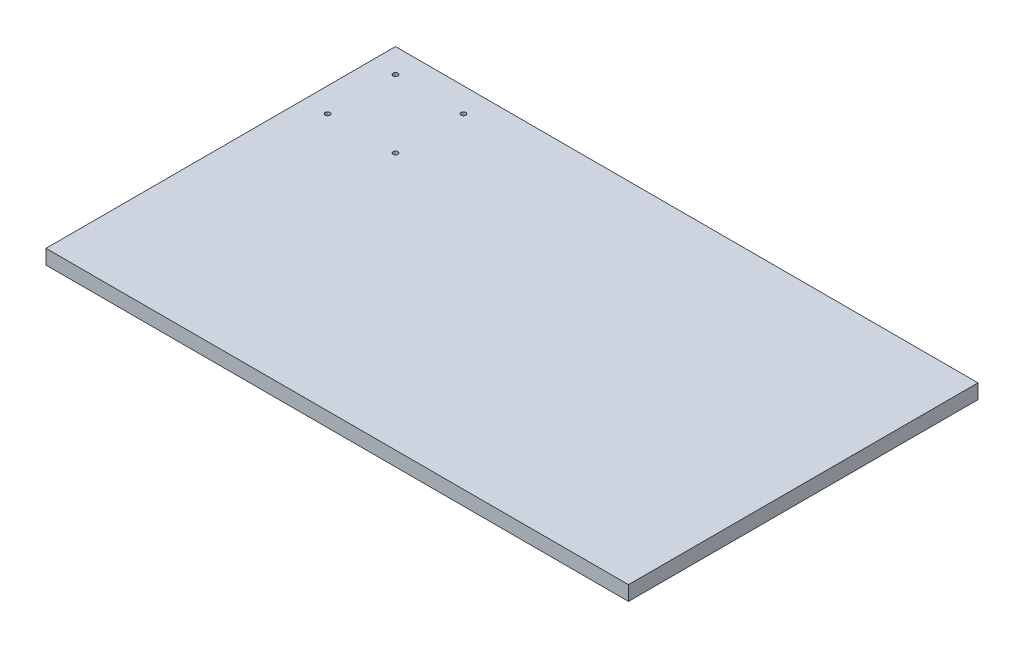
ISO-10303-21;
HEADER;
FILE_DESCRIPTION(('STEP AP214'),'2;1');
FILE_NAME('part.step','',(''),(''),'','','');
FILE_SCHEMA(('AUTOMOTIVE_DESIGN { 1 0 10303 214 1 1 1 1 }'));
ENDSEC;
DATA;
#1=APPLICATION_CONTEXT('core data for automotive mechanical design processes');
#2=APPLICATION_PROTOCOL_DEFINITION('international standard','automotive_design',2000,#1);
#3=PRODUCT_CONTEXT('',#1,'mechanical');
#4=PRODUCT('Part','Part','',(#3));
#5=PRODUCT_RELATED_PRODUCT_CATEGORY('part','',(#4));
#6=PRODUCT_DEFINITION_FORMATION('','',#4);
#7=PRODUCT_DEFINITION_CONTEXT('part definition',#1,'design');
#8=PRODUCT_DEFINITION('design','',#6,#7);
#9=PRODUCT_DEFINITION_SHAPE('','',#8);
#10=(LENGTH_UNIT() NAMED_UNIT(*) SI_UNIT(.MILLI.,.METRE.));
#11=(NAMED_UNIT(*) PLANE_ANGLE_UNIT() SI_UNIT($,.RADIAN.));
#12=(NAMED_UNIT(*) SI_UNIT($,.STERADIAN.) SOLID_ANGLE_UNIT());
#13=UNCERTAINTY_MEASURE_WITH_UNIT(LENGTH_MEASURE(1.E-05),#10,'distance_accuracy_value','');
#14=(GEOMETRIC_REPRESENTATION_CONTEXT(3) GLOBAL_UNCERTAINTY_ASSIGNED_CONTEXT((#13)) GLOBAL_UNIT_ASSIGNED_CONTEXT((#10,
#11,#12)) REPRESENTATION_CONTEXT('',''));
#15=CARTESIAN_POINT('',(0.,0.,0.));
#16=DIRECTION('',(0.,0.,1.));
#17=DIRECTION('',(1.,0.,0.));
#18=AXIS2_PLACEMENT_3D('',#15,#16,#17);
#19=CARTESIAN_POINT('',(0.,76.2,0.));
#20=DIRECTION('',(1.,0.,0.));
#21=DIRECTION('',(0.,0.,-1.));
#22=AXIS2_PLACEMENT_3D('',#19,#20,#21);
#23=PLANE('',#22);
#24=DIRECTION('',(0.,0.,1.));
#25=VECTOR('',#24,1.);
#26=CARTESIAN_POINT('',(0.,0.,0.));
#27=LINE('',#26,#25);
#28=CARTESIAN_POINT('',(0.,0.,-1828.8));
#29=VERTEX_POINT('',#28);
#30=CARTESIAN_POINT('',(0.,0.,0.));
#31=VERTEX_POINT('',#30);
#32=EDGE_CURVE('E147',#29,#31,#27,.T.);
#33=ORIENTED_EDGE('',*,*,#32,.T.);
#34=DIRECTION('',(0.,-1.,0.));
#35=VECTOR('',#34,1.);
#36=CARTESIAN_POINT('',(0.,76.2,0.));
#37=LINE('',#36,#35);
#38=CARTESIAN_POINT('',(0.,76.2,0.));
#39=VERTEX_POINT('',#38);
#40=EDGE_CURVE('E171',#39,#31,#37,.T.);
#41=ORIENTED_EDGE('',*,*,#40,.F.);
#42=DIRECTION('',(0.,0.,1.));
#43=VECTOR('',#42,1.);
#44=CARTESIAN_POINT('',(0.,76.2,0.));
#45=LINE('',#44,#43);
#46=CARTESIAN_POINT('',(0.,76.2,-1828.8));
#47=VERTEX_POINT('',#46);
#48=EDGE_CURVE('E151',#47,#39,#45,.T.);
#49=ORIENTED_EDGE('',*,*,#48,.F.);
#50=DIRECTION('',(0.,-1.,0.));
#51=VECTOR('',#50,1.);
#52=CARTESIAN_POINT('',(0.,76.2,-1828.8));
#53=LINE('',#52,#51);
#54=EDGE_CURVE('E157',#47,#29,#53,.T.);
#55=ORIENTED_EDGE('',*,*,#54,.T.);
#56=EDGE_LOOP('',(#33,#41,#49,#55));
#57=FACE_BOUND('',#56,.T.);
#58=ADVANCED_FACE('F32',(#57),#23,.F.);
#59=CARTESIAN_POINT('',(0.,76.2,0.));
#60=DIRECTION('',(0.,0.,-1.));
#61=DIRECTION('',(-1.,0.,0.));
#62=AXIS2_PLACEMENT_3D('',#59,#60,#61);
#63=PLANE('',#62);
#64=DIRECTION('',(1.,0.,0.));
#65=VECTOR('',#64,1.);
#66=CARTESIAN_POINT('',(0.,0.,0.));
#67=LINE('',#66,#65);
#68=CARTESIAN_POINT('',(3048.,0.,0.));
#69=VERTEX_POINT('',#68);
#70=EDGE_CURVE('E160',#31,#69,#67,.T.);
#71=ORIENTED_EDGE('',*,*,#70,.T.);
#72=DIRECTION('',(0.,-1.,0.));
#73=VECTOR('',#72,1.);
#74=CARTESIAN_POINT('',(3048.,76.2,0.));
#75=LINE('',#74,#73);
#76=CARTESIAN_POINT('',(3048.,76.2,0.));
#77=VERTEX_POINT('',#76);
#78=EDGE_CURVE('E168',#77,#69,#75,.T.);
#79=ORIENTED_EDGE('',*,*,#78,.F.);
#80=DIRECTION('',(1.,0.,0.));
#81=VECTOR('',#80,1.);
#82=CARTESIAN_POINT('',(0.,76.2,0.));
#83=LINE('',#82,#81);
#84=EDGE_CURVE('E85',#39,#77,#83,.T.);
#85=ORIENTED_EDGE('',*,*,#84,.F.);
#86=ORIENTED_EDGE('',*,*,#40,.T.);
#87=EDGE_LOOP('',(#71,#79,#85,#86));
#88=FACE_BOUND('',#87,.T.);
#89=ADVANCED_FACE('F202',(#88),#63,.F.);
#90=CARTESIAN_POINT('',(3048.,76.2,0.));
#91=DIRECTION('',(-1.,0.,0.));
#92=DIRECTION('',(0.,0.,1.));
#93=AXIS2_PLACEMENT_3D('',#90,#91,#92);
#94=PLANE('',#93);
#95=DIRECTION('',(0.,0.,-1.));
#96=VECTOR('',#95,1.);
#97=CARTESIAN_POINT('',(3048.,0.,0.));
#98=LINE('',#97,#96);
#99=CARTESIAN_POINT('',(3048.,0.,-1828.8));
#100=VERTEX_POINT('',#99);
#101=EDGE_CURVE('E162',#69,#100,#98,.T.);
#102=ORIENTED_EDGE('',*,*,#101,.T.);
#103=DIRECTION('',(0.,-1.,0.));
#104=VECTOR('',#103,1.);
#105=CARTESIAN_POINT('',(3048.,76.2,-1828.8));
#106=LINE('',#105,#104);
#107=CARTESIAN_POINT('',(3048.,76.2,-1828.8));
#108=VERTEX_POINT('',#107);
#109=EDGE_CURVE('E166',#108,#100,#106,.T.);
#110=ORIENTED_EDGE('',*,*,#109,.F.);
#111=DIRECTION('',(0.,0.,-1.));
#112=VECTOR('',#111,1.);
#113=CARTESIAN_POINT('',(3048.,76.2,0.));
#114=LINE('',#113,#112);
#115=EDGE_CURVE('E154',#77,#108,#114,.T.);
#116=ORIENTED_EDGE('',*,*,#115,.F.);
#117=ORIENTED_EDGE('',*,*,#78,.T.);
#118=EDGE_LOOP('',(#102,#110,#116,#117));
#119=FACE_BOUND('',#118,.T.);
#120=ADVANCED_FACE('F208',(#119),#94,.F.);
#121=CARTESIAN_POINT('',(0.,76.2,-1828.8));
#122=DIRECTION('',(0.,0.,1.));
#123=DIRECTION('',(1.,0.,0.));
#124=AXIS2_PLACEMENT_3D('',#121,#122,#123);
#125=PLANE('',#124);
#126=DIRECTION('',(-1.,0.,0.));
#127=VECTOR('',#126,1.);
#128=CARTESIAN_POINT('',(0.,0.,-1828.8));
#129=LINE('',#128,#127);
#130=EDGE_CURVE('E77',#100,#29,#129,.T.);
#131=ORIENTED_EDGE('',*,*,#130,.T.);
#132=ORIENTED_EDGE('',*,*,#54,.F.);
#133=DIRECTION('',(-1.,0.,0.));
#134=VECTOR('',#133,1.);
#135=CARTESIAN_POINT('',(0.,76.2,-1828.8));
#136=LINE('',#135,#134);
#137=EDGE_CURVE('E56',#108,#47,#136,.T.);
#138=ORIENTED_EDGE('',*,*,#137,.F.);
#139=ORIENTED_EDGE('',*,*,#109,.T.);
#140=EDGE_LOOP('',(#131,#132,#138,#139));
#141=FACE_BOUND('',#140,.T.);
#142=ADVANCED_FACE('F228',(#141),#125,.F.);
#143=CARTESIAN_POINT('',(0.,76.2,-1828.8));
#144=DIRECTION('',(0.,-1.,0.));
#145=DIRECTION('',(0.,0.,-1.));
#146=AXIS2_PLACEMENT_3D('',#143,#144,#145);
#147=PLANE('',#146);
#148=CARTESIAN_POINT('',(482.6,76.2,-1701.8));
#149=DIRECTION('',(0.,1.,0.));
#150=DIRECTION('',(0.,0.,1.));
#151=AXIS2_PLACEMENT_3D('',#148,#149,#150);
#152=CIRCLE('',#151,12.7);
#153=CARTESIAN_POINT('',(482.6,76.2,-1689.1));
#154=VERTEX_POINT('',#153);
#155=EDGE_CURVE('E343',#154,#154,#152,.T.);
#156=ORIENTED_EDGE('',*,*,#155,.F.);
#157=EDGE_LOOP('',(#156));
#158=FACE_BOUND('',#157,.T.);
#159=CARTESIAN_POINT('',(127.,76.2,-1701.8));
#160=DIRECTION('',(0.,1.,0.));
#161=DIRECTION('',(0.,0.,1.));
#162=AXIS2_PLACEMENT_3D('',#159,#160,#161);
#163=CIRCLE('',#162,12.7);
#164=CARTESIAN_POINT('',(127.,76.2,-1689.1));
#165=VERTEX_POINT('',#164);
#166=EDGE_CURVE('E134',#165,#165,#163,.T.);
#167=ORIENTED_EDGE('',*,*,#166,.F.);
#168=EDGE_LOOP('',(#167));
#169=FACE_BOUND('',#168,.T.);
#170=ORIENTED_EDGE('',*,*,#48,.T.);
#171=ORIENTED_EDGE('',*,*,#84,.T.);
#172=ORIENTED_EDGE('',*,*,#115,.T.);
#173=ORIENTED_EDGE('',*,*,#137,.T.);
#174=EDGE_LOOP('',(#170,#171,#172,#173));
#175=FACE_BOUND('',#174,.T.);
#176=CARTESIAN_POINT('',(127.,76.2,-1346.2));
#177=DIRECTION('',(0.,1.,0.));
#178=DIRECTION('',(0.,0.,1.));
#179=AXIS2_PLACEMENT_3D('',#176,#177,#178);
#180=CIRCLE('',#179,12.7);
#181=CARTESIAN_POINT('',(127.,76.2,-1333.5));
#182=VERTEX_POINT('',#181);
#183=EDGE_CURVE('E178',#182,#182,#180,.T.);
#184=ORIENTED_EDGE('',*,*,#183,.F.);
#185=EDGE_LOOP('',(#184));
#186=FACE_BOUND('',#185,.T.);
#187=CARTESIAN_POINT('',(482.6,76.2,-1346.2));
#188=DIRECTION('',(0.,1.,0.));
#189=DIRECTION('',(0.,0.,1.));
#190=AXIS2_PLACEMENT_3D('',#187,#188,#189);
#191=CIRCLE('',#190,12.7);
#192=CARTESIAN_POINT('',(482.6,76.2,-1333.5));
#193=VERTEX_POINT('',#192);
#194=EDGE_CURVE('E11',#193,#193,#191,.T.);
#195=ORIENTED_EDGE('',*,*,#194,.F.);
#196=EDGE_LOOP('',(#195));
#197=FACE_BOUND('',#196,.T.);
#198=ADVANCED_FACE('F224',(#158,#169,#175,#186,#197),#147,.F.);
#199=CARTESIAN_POINT('',(0.,0.,-1828.8));
#200=DIRECTION('',(0.,-1.,0.));
#201=DIRECTION('',(0.,0.,-1.));
#202=AXIS2_PLACEMENT_3D('',#199,#200,#201);
#203=PLANE('',#202);
#204=DIRECTION('',(0.,0.,-1.));
#205=VECTOR('',#204,1.);
#206=CARTESIAN_POINT('',(76.2,0.,-76.2));
#207=LINE('',#206,#205);
#208=CARTESIAN_POINT('',(76.2,0.,-76.2));
#209=VERTEX_POINT('',#208);
#210=CARTESIAN_POINT('',(76.2,0.,-1752.6));
#211=VERTEX_POINT('',#210);
#212=EDGE_CURVE('E47',#209,#211,#207,.T.);
#213=ORIENTED_EDGE('',*,*,#212,.F.);
#214=DIRECTION('',(-1.,0.,0.));
#215=VECTOR('',#214,1.);
#216=CARTESIAN_POINT('',(76.2,0.,-76.2));
#217=LINE('',#216,#215);
#218=CARTESIAN_POINT('',(2971.8,0.,-76.2));
#219=VERTEX_POINT('',#218);
#220=EDGE_CURVE('E128',#219,#209,#217,.T.);
#221=ORIENTED_EDGE('',*,*,#220,.F.);
#222=DIRECTION('',(0.,0.,1.));
#223=VECTOR('',#222,1.);
#224=CARTESIAN_POINT('',(2971.8,0.,-76.2));
#225=LINE('',#224,#223);
#226=CARTESIAN_POINT('',(2971.8,0.,-1752.6));
#227=VERTEX_POINT('',#226);
#228=EDGE_CURVE('E131',#227,#219,#225,.T.);
#229=ORIENTED_EDGE('',*,*,#228,.F.);
#230=DIRECTION('',(1.,0.,0.));
#231=VECTOR('',#230,1.);
#232=CARTESIAN_POINT('',(76.2,0.,-1752.6));
#233=LINE('',#232,#231);
#234=EDGE_CURVE('E140',#211,#227,#233,.T.);
#235=ORIENTED_EDGE('',*,*,#234,.F.);
#236=EDGE_LOOP('',(#213,#221,#229,#235));
#237=FACE_BOUND('',#236,.T.);
#238=ORIENTED_EDGE('',*,*,#32,.F.);
#239=ORIENTED_EDGE('',*,*,#130,.F.);
#240=ORIENTED_EDGE('',*,*,#101,.F.);
#241=ORIENTED_EDGE('',*,*,#70,.F.);
#242=EDGE_LOOP('',(#238,#239,#240,#241));
#243=FACE_BOUND('',#242,.T.);
#244=ADVANCED_FACE('F227',(#237,#243),#203,.T.);
#245=CARTESIAN_POINT('',(76.2,50.8,-76.2));
#246=DIRECTION('',(-1.,0.,0.));
#247=DIRECTION('',(0.,0.,1.));
#248=AXIS2_PLACEMENT_3D('',#245,#246,#247);
#249=PLANE('',#248);
#250=ORIENTED_EDGE('',*,*,#212,.T.);
#251=DIRECTION('',(0.,-1.,0.));
#252=VECTOR('',#251,1.);
#253=CARTESIAN_POINT('',(76.2,50.8,-1752.6));
#254=LINE('',#253,#252);
#255=CARTESIAN_POINT('',(76.2,50.8,-1752.6));
#256=VERTEX_POINT('',#255);
#257=EDGE_CURVE('E105',#256,#211,#254,.T.);
#258=ORIENTED_EDGE('',*,*,#257,.F.);
#259=DIRECTION('',(0.,0.,-1.));
#260=VECTOR('',#259,1.);
#261=CARTESIAN_POINT('',(76.2,50.8,-76.2));
#262=LINE('',#261,#260);
#263=CARTESIAN_POINT('',(76.2,50.8,-76.2));
#264=VERTEX_POINT('',#263);
#265=EDGE_CURVE('E109',#264,#256,#262,.T.);
#266=ORIENTED_EDGE('',*,*,#265,.F.);
#267=DIRECTION('',(0.,-1.,0.));
#268=VECTOR('',#267,1.);
#269=CARTESIAN_POINT('',(76.2,50.8,-76.2));
#270=LINE('',#269,#268);
#271=EDGE_CURVE('E145',#264,#209,#270,.T.);
#272=ORIENTED_EDGE('',*,*,#271,.T.);
#273=EDGE_LOOP('',(#250,#258,#266,#272));
#274=FACE_BOUND('',#273,.T.);
#275=ADVANCED_FACE('F107',(#274),#249,.F.);
#276=CARTESIAN_POINT('',(76.2,50.8,-76.2));
#277=DIRECTION('',(0.,0.,1.));
#278=DIRECTION('',(1.,0.,0.));
#279=AXIS2_PLACEMENT_3D('',#276,#277,#278);
#280=PLANE('',#279);
#281=ORIENTED_EDGE('',*,*,#220,.T.);
#282=ORIENTED_EDGE('',*,*,#271,.F.);
#283=DIRECTION('',(-1.,0.,0.));
#284=VECTOR('',#283,1.);
#285=CARTESIAN_POINT('',(76.2,50.8,-76.2));
#286=LINE('',#285,#284);
#287=CARTESIAN_POINT('',(2971.8,50.8,-76.2));
#288=VERTEX_POINT('',#287);
#289=EDGE_CURVE('E115',#288,#264,#286,.T.);
#290=ORIENTED_EDGE('',*,*,#289,.F.);
#291=DIRECTION('',(0.,-1.,0.));
#292=VECTOR('',#291,1.);
#293=CARTESIAN_POINT('',(2971.8,50.8,-76.2));
#294=LINE('',#293,#292);
#295=EDGE_CURVE('E148',#288,#219,#294,.T.);
#296=ORIENTED_EDGE('',*,*,#295,.T.);
#297=EDGE_LOOP('',(#281,#282,#290,#296));
#298=FACE_BOUND('',#297,.T.);
#299=ADVANCED_FACE('F275',(#298),#280,.F.);
#300=CARTESIAN_POINT('',(2971.8,50.8,-76.2));
#301=DIRECTION('',(1.,0.,0.));
#302=DIRECTION('',(0.,0.,-1.));
#303=AXIS2_PLACEMENT_3D('',#300,#301,#302);
#304=PLANE('',#303);
#305=ORIENTED_EDGE('',*,*,#228,.T.);
#306=ORIENTED_EDGE('',*,*,#295,.F.);
#307=DIRECTION('',(0.,0.,1.));
#308=VECTOR('',#307,1.);
#309=CARTESIAN_POINT('',(2971.8,50.8,-76.2));
#310=LINE('',#309,#308);
#311=CARTESIAN_POINT('',(2971.8,50.8,-1752.6));
#312=VERTEX_POINT('',#311);
#313=EDGE_CURVE('E123',#312,#288,#310,.T.);
#314=ORIENTED_EDGE('',*,*,#313,.F.);
#315=DIRECTION('',(0.,-1.,0.));
#316=VECTOR('',#315,1.);
#317=CARTESIAN_POINT('',(2971.8,50.8,-1752.6));
#318=LINE('',#317,#316);
#319=EDGE_CURVE('E114',#312,#227,#318,.T.);
#320=ORIENTED_EDGE('',*,*,#319,.T.);
#321=EDGE_LOOP('',(#305,#306,#314,#320));
#322=FACE_BOUND('',#321,.T.);
#323=ADVANCED_FACE('F196',(#322),#304,.F.);
#324=CARTESIAN_POINT('',(76.2,50.8,-1752.6));
#325=DIRECTION('',(0.,0.,-1.));
#326=DIRECTION('',(-1.,0.,0.));
#327=AXIS2_PLACEMENT_3D('',#324,#325,#326);
#328=PLANE('',#327);
#329=ORIENTED_EDGE('',*,*,#234,.T.);
#330=ORIENTED_EDGE('',*,*,#319,.F.);
#331=DIRECTION('',(1.,0.,0.));
#332=VECTOR('',#331,1.);
#333=CARTESIAN_POINT('',(76.2,50.8,-1752.6));
#334=LINE('',#333,#332);
#335=EDGE_CURVE('E118',#256,#312,#334,.T.);
#336=ORIENTED_EDGE('',*,*,#335,.F.);
#337=ORIENTED_EDGE('',*,*,#257,.T.);
#338=EDGE_LOOP('',(#329,#330,#336,#337));
#339=FACE_BOUND('',#338,.T.);
#340=ADVANCED_FACE('F119',(#339),#328,.F.);
#341=CARTESIAN_POINT('',(76.2,50.8,-1752.6));
#342=DIRECTION('',(0.,-1.,0.));
#343=DIRECTION('',(0.,0.,-1.));
#344=AXIS2_PLACEMENT_3D('',#341,#342,#343);
#345=PLANE('',#344);
#346=CARTESIAN_POINT('',(482.6,50.8,-1701.8));
#347=DIRECTION('',(0.,-1.,0.));
#348=DIRECTION('',(0.,0.,-1.));
#349=AXIS2_PLACEMENT_3D('',#346,#347,#348);
#350=CIRCLE('',#349,12.7);
#351=CARTESIAN_POINT('',(482.6,50.8,-1714.5));
#352=VERTEX_POINT('',#351);
#353=EDGE_CURVE('E347',#352,#352,#350,.T.);
#354=ORIENTED_EDGE('',*,*,#353,.F.);
#355=EDGE_LOOP('',(#354));
#356=FACE_BOUND('',#355,.T.);
#357=CARTESIAN_POINT('',(127.,50.8,-1701.8));
#358=DIRECTION('',(0.,-1.,0.));
#359=DIRECTION('',(0.,0.,-1.));
#360=AXIS2_PLACEMENT_3D('',#357,#358,#359);
#361=CIRCLE('',#360,12.7);
#362=CARTESIAN_POINT('',(127.,50.8,-1714.5));
#363=VERTEX_POINT('',#362);
#364=EDGE_CURVE('E141',#363,#363,#361,.T.);
#365=ORIENTED_EDGE('',*,*,#364,.F.);
#366=EDGE_LOOP('',(#365));
#367=FACE_BOUND('',#366,.T.);
#368=ORIENTED_EDGE('',*,*,#265,.T.);
#369=ORIENTED_EDGE('',*,*,#335,.T.);
#370=ORIENTED_EDGE('',*,*,#313,.T.);
#371=ORIENTED_EDGE('',*,*,#289,.T.);
#372=EDGE_LOOP('',(#368,#369,#370,#371));
#373=FACE_BOUND('',#372,.T.);
#374=CARTESIAN_POINT('',(127.,50.8,-1346.2));
#375=DIRECTION('',(0.,-1.,0.));
#376=DIRECTION('',(0.,0.,-1.));
#377=AXIS2_PLACEMENT_3D('',#374,#375,#376);
#378=CIRCLE('',#377,12.7);
#379=CARTESIAN_POINT('',(127.,50.8,-1358.9));
#380=VERTEX_POINT('',#379);
#381=EDGE_CURVE('E173',#380,#380,#378,.T.);
#382=ORIENTED_EDGE('',*,*,#381,.F.);
#383=EDGE_LOOP('',(#382));
#384=FACE_BOUND('',#383,.T.);
#385=CARTESIAN_POINT('',(482.6,50.8,-1346.2));
#386=DIRECTION('',(0.,-1.,0.));
#387=DIRECTION('',(0.,0.,-1.));
#388=AXIS2_PLACEMENT_3D('',#385,#386,#387);
#389=CIRCLE('',#388,12.7);
#390=CARTESIAN_POINT('',(482.6,50.8,-1358.9));
#391=VERTEX_POINT('',#390);
#392=EDGE_CURVE('E40',#391,#391,#389,.T.);
#393=ORIENTED_EDGE('',*,*,#392,.F.);
#394=EDGE_LOOP('',(#393));
#395=FACE_BOUND('',#394,.T.);
#396=ADVANCED_FACE('F125',(#356,#367,#373,#384,#395),#345,.T.);
#397=CARTESIAN_POINT('',(127.,0.,-1701.8));
#398=DIRECTION('',(0.,1.,0.));
#399=DIRECTION('',(0.,0.,1.));
#400=AXIS2_PLACEMENT_3D('',#397,#398,#399);
#401=CYLINDRICAL_SURFACE('',#400,12.7);
#402=ORIENTED_EDGE('',*,*,#364,.T.);
#403=EDGE_LOOP('',(#402));
#404=FACE_BOUND('',#403,.T.);
#405=ORIENTED_EDGE('',*,*,#166,.T.);
#406=EDGE_LOOP('',(#405));
#407=FACE_BOUND('',#406,.T.);
#408=ADVANCED_FACE('F186',(#404,#407),#401,.F.);
#409=CARTESIAN_POINT('',(482.6,0.,-1701.8));
#410=DIRECTION('',(0.,1.,0.));
#411=DIRECTION('',(0.,0.,1.));
#412=AXIS2_PLACEMENT_3D('',#409,#410,#411);
#413=CYLINDRICAL_SURFACE('',#412,12.7);
#414=ORIENTED_EDGE('',*,*,#353,.T.);
#415=EDGE_LOOP('',(#414));
#416=FACE_BOUND('',#415,.T.);
#417=ORIENTED_EDGE('',*,*,#155,.T.);
#418=EDGE_LOOP('',(#417));
#419=FACE_BOUND('',#418,.T.);
#420=ADVANCED_FACE('F193',(#416,#419),#413,.F.);
#421=CARTESIAN_POINT('',(127.,0.,-1346.2));
#422=DIRECTION('',(0.,1.,0.));
#423=DIRECTION('',(0.,0.,1.));
#424=AXIS2_PLACEMENT_3D('',#421,#422,#423);
#425=CYLINDRICAL_SURFACE('',#424,12.7);
#426=ORIENTED_EDGE('',*,*,#381,.T.);
#427=EDGE_LOOP('',(#426));
#428=FACE_BOUND('',#427,.T.);
#429=ORIENTED_EDGE('',*,*,#183,.T.);
#430=EDGE_LOOP('',(#429));
#431=FACE_BOUND('',#430,.T.);
#432=ADVANCED_FACE('F211',(#428,#431),#425,.F.);
#433=CARTESIAN_POINT('',(482.6,0.,-1346.2));
#434=DIRECTION('',(0.,1.,0.));
#435=DIRECTION('',(0.,0.,1.));
#436=AXIS2_PLACEMENT_3D('',#433,#434,#435);
#437=CYLINDRICAL_SURFACE('',#436,12.7);
#438=ORIENTED_EDGE('',*,*,#392,.T.);
#439=EDGE_LOOP('',(#438));
#440=FACE_BOUND('',#439,.T.);
#441=ORIENTED_EDGE('',*,*,#194,.T.);
#442=EDGE_LOOP('',(#441));
#443=FACE_BOUND('',#442,.T.);
#444=ADVANCED_FACE('F34',(#440,#443),#437,.F.);
#445=CLOSED_SHELL('',(#58,#89,#120,#142,#198,#244,#275,#299,#323,#340,#396,#408,#420,#432,#444));
#446=MANIFOLD_SOLID_BREP('B2',#445);
#447=ADVANCED_BREP_SHAPE_REPRESENTATION('',(#18,#446),#14);
#448=SHAPE_DEFINITION_REPRESENTATION(#9,#447);
ENDSEC;
END-ISO-10303-21;
